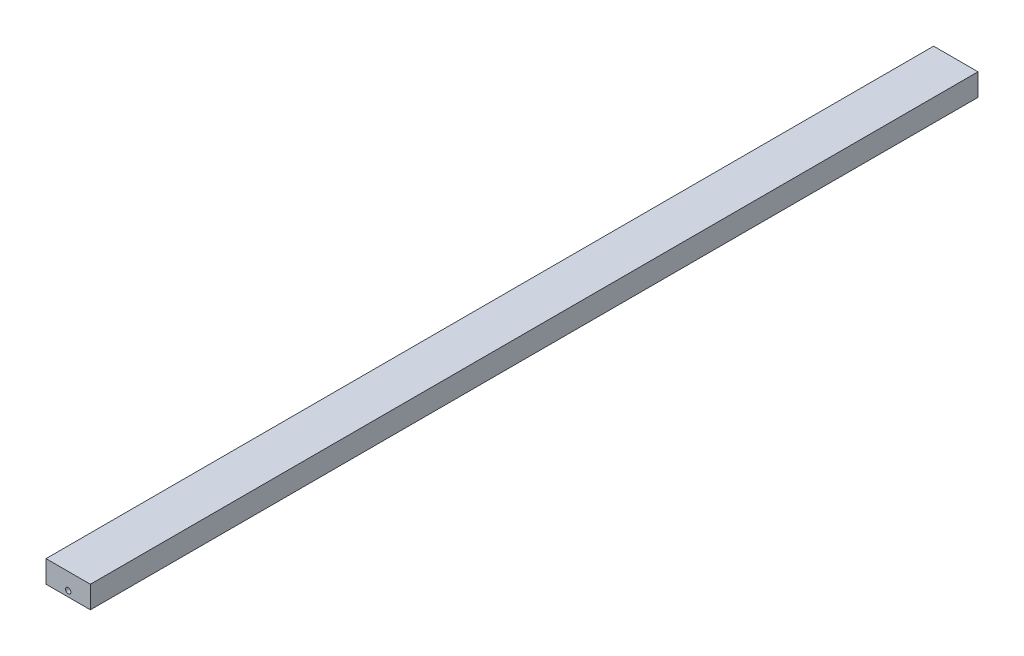
ISO-10303-21;
HEADER;
FILE_DESCRIPTION(('STEP AP214'),'2;1');
FILE_NAME('part.step','',(''),(''),'','','');
FILE_SCHEMA(('AUTOMOTIVE_DESIGN { 1 0 10303 214 1 1 1 1 }'));
ENDSEC;
DATA;
#1=APPLICATION_CONTEXT('core data for automotive mechanical design processes');
#2=APPLICATION_PROTOCOL_DEFINITION('international standard','automotive_design',2000,#1);
#3=PRODUCT_CONTEXT('',#1,'mechanical');
#4=PRODUCT('Part','Part','',(#3));
#5=PRODUCT_RELATED_PRODUCT_CATEGORY('part','',(#4));
#6=PRODUCT_DEFINITION_FORMATION('','',#4);
#7=PRODUCT_DEFINITION_CONTEXT('part definition',#1,'design');
#8=PRODUCT_DEFINITION('design','',#6,#7);
#9=PRODUCT_DEFINITION_SHAPE('','',#8);
#10=(LENGTH_UNIT() NAMED_UNIT(*) SI_UNIT(.MILLI.,.METRE.));
#11=(NAMED_UNIT(*) PLANE_ANGLE_UNIT() SI_UNIT($,.RADIAN.));
#12=(NAMED_UNIT(*) SI_UNIT($,.STERADIAN.) SOLID_ANGLE_UNIT());
#13=UNCERTAINTY_MEASURE_WITH_UNIT(LENGTH_MEASURE(1.E-05),#10,'distance_accuracy_value','');
#14=(GEOMETRIC_REPRESENTATION_CONTEXT(3) GLOBAL_UNCERTAINTY_ASSIGNED_CONTEXT((#13)) GLOBAL_UNIT_ASSIGNED_CONTEXT((#10,
#11,#12)) REPRESENTATION_CONTEXT('',''));
#15=CARTESIAN_POINT('',(0.,0.,0.));
#16=DIRECTION('',(0.,0.,1.));
#17=DIRECTION('',(1.,0.,0.));
#18=AXIS2_PLACEMENT_3D('',#15,#16,#17);
#19=CARTESIAN_POINT('',(5.,2.5,200.));
#20=DIRECTION('',(-1.,0.,0.));
#21=DIRECTION('',(0.,0.,1.));
#22=AXIS2_PLACEMENT_3D('',#19,#20,#21);
#23=PLANE('',#22);
#24=DIRECTION('',(0.,1.,0.));
#25=VECTOR('',#24,1.);
#26=CARTESIAN_POINT('',(5.,2.5,0.));
#27=LINE('',#26,#25);
#28=CARTESIAN_POINT('',(5.,-2.5,0.));
#29=VERTEX_POINT('',#28);
#30=CARTESIAN_POINT('',(5.,2.5,0.));
#31=VERTEX_POINT('',#30);
#32=EDGE_CURVE('E96',#29,#31,#27,.T.);
#33=ORIENTED_EDGE('',*,*,#32,.T.);
#34=DIRECTION('',(0.,0.,-1.));
#35=VECTOR('',#34,1.);
#36=CARTESIAN_POINT('',(5.,2.5,200.));
#37=LINE('',#36,#35);
#38=CARTESIAN_POINT('',(5.,2.5,200.));
#39=VERTEX_POINT('',#38);
#40=EDGE_CURVE('E11',#39,#31,#37,.T.);
#41=ORIENTED_EDGE('',*,*,#40,.F.);
#42=DIRECTION('',(0.,1.,0.));
#43=VECTOR('',#42,1.);
#44=CARTESIAN_POINT('',(5.,2.5,200.));
#45=LINE('',#44,#43);
#46=CARTESIAN_POINT('',(5.,-2.5,200.));
#47=VERTEX_POINT('',#46);
#48=EDGE_CURVE('E84',#47,#39,#45,.T.);
#49=ORIENTED_EDGE('',*,*,#48,.F.);
#50=DIRECTION('',(0.,0.,-1.));
#51=VECTOR('',#50,1.);
#52=CARTESIAN_POINT('',(5.,-2.5,200.));
#53=LINE('',#52,#51);
#54=EDGE_CURVE('E92',#47,#29,#53,.T.);
#55=ORIENTED_EDGE('',*,*,#54,.T.);
#56=EDGE_LOOP('',(#33,#41,#49,#55));
#57=FACE_BOUND('',#56,.T.);
#58=ADVANCED_FACE('F33',(#57),#23,.F.);
#59=CARTESIAN_POINT('',(-5.,2.5,200.));
#60=DIRECTION('',(0.,-1.,0.));
#61=DIRECTION('',(0.,0.,-1.));
#62=AXIS2_PLACEMENT_3D('',#59,#60,#61);
#63=PLANE('',#62);
#64=DIRECTION('',(-1.,0.,0.));
#65=VECTOR('',#64,1.);
#66=CARTESIAN_POINT('',(-5.,2.5,0.));
#67=LINE('',#66,#65);
#68=CARTESIAN_POINT('',(-5.,2.5,0.));
#69=VERTEX_POINT('',#68);
#70=EDGE_CURVE('E88',#31,#69,#67,.T.);
#71=ORIENTED_EDGE('',*,*,#70,.T.);
#72=DIRECTION('',(0.,0.,-1.));
#73=VECTOR('',#72,1.);
#74=CARTESIAN_POINT('',(-5.,2.5,200.));
#75=LINE('',#74,#73);
#76=CARTESIAN_POINT('',(-5.,2.5,200.));
#77=VERTEX_POINT('',#76);
#78=EDGE_CURVE('E41',#77,#69,#75,.T.);
#79=ORIENTED_EDGE('',*,*,#78,.F.);
#80=DIRECTION('',(-1.,0.,0.));
#81=VECTOR('',#80,1.);
#82=CARTESIAN_POINT('',(-5.,2.5,200.));
#83=LINE('',#82,#81);
#84=EDGE_CURVE('E79',#39,#77,#83,.T.);
#85=ORIENTED_EDGE('',*,*,#84,.F.);
#86=ORIENTED_EDGE('',*,*,#40,.T.);
#87=EDGE_LOOP('',(#71,#79,#85,#86));
#88=FACE_BOUND('',#87,.T.);
#89=ADVANCED_FACE('F87',(#88),#63,.F.);
#90=CARTESIAN_POINT('',(-5.,2.5,200.));
#91=DIRECTION('',(1.,0.,0.));
#92=DIRECTION('',(0.,0.,-1.));
#93=AXIS2_PLACEMENT_3D('',#90,#91,#92);
#94=PLANE('',#93);
#95=DIRECTION('',(0.,-1.,0.));
#96=VECTOR('',#95,1.);
#97=CARTESIAN_POINT('',(-5.,2.5,0.));
#98=LINE('',#97,#96);
#99=CARTESIAN_POINT('',(-5.,-2.5,0.));
#100=VERTEX_POINT('',#99);
#101=EDGE_CURVE('E66',#69,#100,#98,.T.);
#102=ORIENTED_EDGE('',*,*,#101,.T.);
#103=DIRECTION('',(0.,0.,-1.));
#104=VECTOR('',#103,1.);
#105=CARTESIAN_POINT('',(-5.,-2.5,200.));
#106=LINE('',#105,#104);
#107=CARTESIAN_POINT('',(-5.,-2.5,200.));
#108=VERTEX_POINT('',#107);
#109=EDGE_CURVE('E89',#108,#100,#106,.T.);
#110=ORIENTED_EDGE('',*,*,#109,.F.);
#111=DIRECTION('',(0.,-1.,0.));
#112=VECTOR('',#111,1.);
#113=CARTESIAN_POINT('',(-5.,2.5,200.));
#114=LINE('',#113,#112);
#115=EDGE_CURVE('E82',#77,#108,#114,.T.);
#116=ORIENTED_EDGE('',*,*,#115,.F.);
#117=ORIENTED_EDGE('',*,*,#78,.T.);
#118=EDGE_LOOP('',(#102,#110,#116,#117));
#119=FACE_BOUND('',#118,.T.);
#120=ADVANCED_FACE('F90',(#119),#94,.F.);
#121=CARTESIAN_POINT('',(-5.,-2.5,200.));
#122=DIRECTION('',(0.,1.,0.));
#123=DIRECTION('',(0.,0.,1.));
#124=AXIS2_PLACEMENT_3D('',#121,#122,#123);
#125=PLANE('',#124);
#126=DIRECTION('',(1.,0.,0.));
#127=VECTOR('',#126,1.);
#128=CARTESIAN_POINT('',(-5.,-2.5,0.));
#129=LINE('',#128,#127);
#130=EDGE_CURVE('E72',#100,#29,#129,.T.);
#131=ORIENTED_EDGE('',*,*,#130,.T.);
#132=ORIENTED_EDGE('',*,*,#54,.F.);
#133=DIRECTION('',(1.,0.,0.));
#134=VECTOR('',#133,1.);
#135=CARTESIAN_POINT('',(-5.,-2.5,200.));
#136=LINE('',#135,#134);
#137=EDGE_CURVE('E49',#108,#47,#136,.T.);
#138=ORIENTED_EDGE('',*,*,#137,.F.);
#139=ORIENTED_EDGE('',*,*,#109,.T.);
#140=EDGE_LOOP('',(#131,#132,#138,#139));
#141=FACE_BOUND('',#140,.T.);
#142=ADVANCED_FACE('F104',(#141),#125,.F.);
#143=CARTESIAN_POINT('',(0.,0.,200.));
#144=DIRECTION('',(0.,0.,1.));
#145=DIRECTION('',(1.,0.,0.));
#146=AXIS2_PLACEMENT_3D('',#143,#144,#145);
#147=PLANE('',#146);
#148=CARTESIAN_POINT('',(0.,-1.25,200.));
#149=DIRECTION('',(0.,0.,1.));
#150=DIRECTION('',(1.,0.,0.));
#151=AXIS2_PLACEMENT_3D('',#148,#149,#150);
#152=CIRCLE('',#151,0.6);
#153=CARTESIAN_POINT('',(0.6,-1.25,200.));
#154=VERTEX_POINT('',#153);
#155=EDGE_CURVE('E99',#154,#154,#152,.T.);
#156=ORIENTED_EDGE('',*,*,#155,.F.);
#157=EDGE_LOOP('',(#156));
#158=FACE_BOUND('',#157,.T.);
#159=ORIENTED_EDGE('',*,*,#48,.T.);
#160=ORIENTED_EDGE('',*,*,#84,.T.);
#161=ORIENTED_EDGE('',*,*,#115,.T.);
#162=ORIENTED_EDGE('',*,*,#137,.T.);
#163=EDGE_LOOP('',(#159,#160,#161,#162));
#164=FACE_BOUND('',#163,.T.);
#165=ADVANCED_FACE('F80',(#158,#164),#147,.T.);
#166=CARTESIAN_POINT('',(0.,0.,0.));
#167=DIRECTION('',(0.,0.,1.));
#168=DIRECTION('',(1.,0.,0.));
#169=AXIS2_PLACEMENT_3D('',#166,#167,#168);
#170=PLANE('',#169);
#171=CARTESIAN_POINT('',(0.,-1.25,0.));
#172=DIRECTION('',(0.,0.,1.));
#173=DIRECTION('',(1.,0.,0.));
#174=AXIS2_PLACEMENT_3D('',#171,#172,#173);
#175=CIRCLE('',#174,0.6);
#176=CARTESIAN_POINT('',(0.6,-1.25,0.));
#177=VERTEX_POINT('',#176);
#178=EDGE_CURVE('E110',#177,#177,#175,.T.);
#179=ORIENTED_EDGE('',*,*,#178,.T.);
#180=EDGE_LOOP('',(#179));
#181=FACE_BOUND('',#180,.T.);
#182=ORIENTED_EDGE('',*,*,#32,.F.);
#183=ORIENTED_EDGE('',*,*,#130,.F.);
#184=ORIENTED_EDGE('',*,*,#101,.F.);
#185=ORIENTED_EDGE('',*,*,#70,.F.);
#186=EDGE_LOOP('',(#182,#183,#184,#185));
#187=FACE_BOUND('',#186,.T.);
#188=ADVANCED_FACE('F107',(#181,#187),#170,.F.);
#189=CARTESIAN_POINT('',(0.,-1.25,200.));
#190=DIRECTION('',(0.,0.,-1.));
#191=DIRECTION('',(-1.,0.,0.));
#192=AXIS2_PLACEMENT_3D('',#189,#190,#191);
#193=CYLINDRICAL_SURFACE('',#192,0.6);
#194=ORIENTED_EDGE('',*,*,#155,.T.);
#195=EDGE_LOOP('',(#194));
#196=FACE_BOUND('',#195,.T.);
#197=ORIENTED_EDGE('',*,*,#178,.F.);
#198=EDGE_LOOP('',(#197));
#199=FACE_BOUND('',#198,.T.);
#200=ADVANCED_FACE('F116',(#196,#199),#193,.F.);
#201=CLOSED_SHELL('',(#58,#89,#120,#142,#165,#188,#200));
#202=MANIFOLD_SOLID_BREP('B2',#201);
#203=ADVANCED_BREP_SHAPE_REPRESENTATION('',(#18,#202),#14);
#204=SHAPE_DEFINITION_REPRESENTATION(#9,#203);
ENDSEC;
END-ISO-10303-21;
